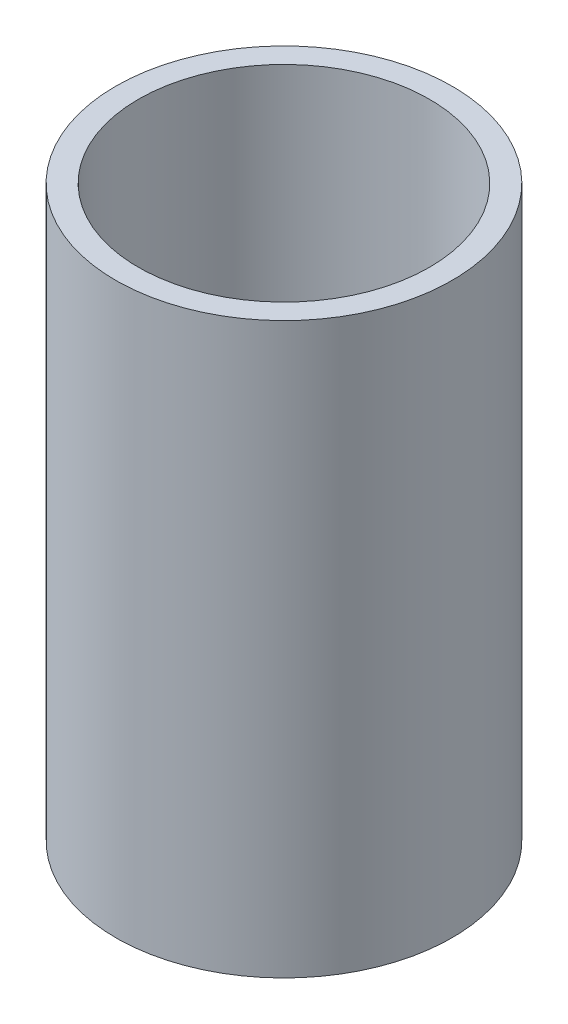
ISO-10303-21;
HEADER;
FILE_DESCRIPTION(('STEP AP214'),'2;1');
FILE_NAME('part.step','',(''),(''),'','','');
FILE_SCHEMA(('AUTOMOTIVE_DESIGN { 1 0 10303 214 1 1 1 1 }'));
ENDSEC;
DATA;
#1=APPLICATION_CONTEXT('core data for automotive mechanical design processes');
#2=APPLICATION_PROTOCOL_DEFINITION('international standard','automotive_design',2000,#1);
#3=PRODUCT_CONTEXT('',#1,'mechanical');
#4=PRODUCT('Part','Part','',(#3));
#5=PRODUCT_RELATED_PRODUCT_CATEGORY('part','',(#4));
#6=PRODUCT_DEFINITION_FORMATION('','',#4);
#7=PRODUCT_DEFINITION_CONTEXT('part definition',#1,'design');
#8=PRODUCT_DEFINITION('design','',#6,#7);
#9=PRODUCT_DEFINITION_SHAPE('','',#8);
#10=(LENGTH_UNIT() NAMED_UNIT(*) SI_UNIT(.MILLI.,.METRE.));
#11=(NAMED_UNIT(*) PLANE_ANGLE_UNIT() SI_UNIT($,.RADIAN.));
#12=(NAMED_UNIT(*) SI_UNIT($,.STERADIAN.) SOLID_ANGLE_UNIT());
#13=UNCERTAINTY_MEASURE_WITH_UNIT(LENGTH_MEASURE(1.E-05),#10,'distance_accuracy_value','');
#14=(GEOMETRIC_REPRESENTATION_CONTEXT(3) GLOBAL_UNCERTAINTY_ASSIGNED_CONTEXT((#13)) GLOBAL_UNIT_ASSIGNED_CONTEXT((#10,
#11,#12)) REPRESENTATION_CONTEXT('',''));
#15=CARTESIAN_POINT('',(0.,0.,0.));
#16=DIRECTION('',(0.,0.,1.));
#17=DIRECTION('',(1.,0.,0.));
#18=AXIS2_PLACEMENT_3D('',#15,#16,#17);
#19=CARTESIAN_POINT('',(-15.6,52.8,0.));
#20=DIRECTION('',(0.,1.,0.));
#21=DIRECTION('',(1.,0.,0.));
#22=AXIS2_PLACEMENT_3D('',#19,#20,#21);
#23=PLANE('',#22);
#24=CARTESIAN_POINT('',(-15.6,52.8,0.));
#25=DIRECTION('',(0.,1.,0.));
#26=DIRECTION('',(1.,0.,0.));
#27=AXIS2_PLACEMENT_3D('',#24,#25,#26);
#28=CIRCLE('',#27,9.);
#29=CARTESIAN_POINT('',(-24.6,52.8,0.));
#30=VERTEX_POINT('',#29);
#31=EDGE_CURVE('E62',#30,#30,#28,.T.);
#32=ORIENTED_EDGE('',*,*,#31,.T.);
#33=EDGE_LOOP('',(#32));
#34=FACE_BOUND('',#33,.T.);
#35=CARTESIAN_POINT('',(-15.6,52.8,0.));
#36=DIRECTION('',(0.,1.,0.));
#37=DIRECTION('',(1.,0.,0.));
#38=AXIS2_PLACEMENT_3D('',#35,#36,#37);
#39=CIRCLE('',#38,10.4);
#40=CARTESIAN_POINT('',(-26.,52.8,0.));
#41=VERTEX_POINT('',#40);
#42=EDGE_CURVE('E10',#41,#41,#39,.T.);
#43=ORIENTED_EDGE('',*,*,#42,.F.);
#44=EDGE_LOOP('',(#43));
#45=FACE_BOUND('',#44,.T.);
#46=ADVANCED_FACE('F15',(#34,#45),#23,.F.);
#47=CARTESIAN_POINT('',(-15.6,88.,0.));
#48=DIRECTION('',(0.,1.,0.));
#49=DIRECTION('',(1.,0.,0.));
#50=AXIS2_PLACEMENT_3D('',#47,#48,#49);
#51=PLANE('',#50);
#52=CARTESIAN_POINT('',(-15.6,88.,0.));
#53=DIRECTION('',(0.,-1.,0.));
#54=DIRECTION('',(1.,0.,0.));
#55=AXIS2_PLACEMENT_3D('',#52,#53,#54);
#56=CIRCLE('',#55,9.);
#57=CARTESIAN_POINT('',(-24.6,88.,0.));
#58=VERTEX_POINT('',#57);
#59=EDGE_CURVE('E46',#58,#58,#56,.T.);
#60=ORIENTED_EDGE('',*,*,#59,.T.);
#61=EDGE_LOOP('',(#60));
#62=FACE_BOUND('',#61,.T.);
#63=CARTESIAN_POINT('',(-15.6,88.,0.));
#64=DIRECTION('',(0.,1.,0.));
#65=DIRECTION('',(1.,0.,0.));
#66=AXIS2_PLACEMENT_3D('',#63,#64,#65);
#67=CIRCLE('',#66,10.4);
#68=CARTESIAN_POINT('',(-26.,88.,0.));
#69=VERTEX_POINT('',#68);
#70=EDGE_CURVE('E52',#69,#69,#67,.T.);
#71=ORIENTED_EDGE('',*,*,#70,.T.);
#72=EDGE_LOOP('',(#71));
#73=FACE_BOUND('',#72,.T.);
#74=ADVANCED_FACE('F47',(#62,#73),#51,.T.);
#75=CARTESIAN_POINT('',(-15.6,52.8,0.));
#76=DIRECTION('',(0.,1.,0.));
#77=DIRECTION('',(1.,0.,0.));
#78=AXIS2_PLACEMENT_3D('',#75,#76,#77);
#79=CYLINDRICAL_SURFACE('',#78,10.4);
#80=ORIENTED_EDGE('',*,*,#70,.F.);
#81=DIRECTION('',(0.,-1.,0.));
#82=VECTOR('',#81,1.);
#83=CARTESIAN_POINT('',(-26.,52.8,0.));
#84=LINE('',#83,#82);
#85=EDGE_CURVE('E25',#69,#41,#84,.T.);
#86=ORIENTED_EDGE('',*,*,#85,.T.);
#87=ORIENTED_EDGE('',*,*,#42,.T.);
#88=ORIENTED_EDGE('',*,*,#85,.F.);
#89=EDGE_LOOP('',(#80,#86,#87,#88));
#90=FACE_BOUND('',#89,.T.);
#91=ADVANCED_FACE('F69',(#90),#79,.T.);
#92=CARTESIAN_POINT('',(-15.6,52.8,0.));
#93=DIRECTION('',(0.,1.,0.));
#94=DIRECTION('',(1.,0.,0.));
#95=AXIS2_PLACEMENT_3D('',#92,#93,#94);
#96=CYLINDRICAL_SURFACE('',#95,9.);
#97=ORIENTED_EDGE('',*,*,#31,.F.);
#98=DIRECTION('',(0.,1.,0.));
#99=VECTOR('',#98,1.);
#100=CARTESIAN_POINT('',(-24.6,52.8,0.));
#101=LINE('',#100,#99);
#102=EDGE_CURVE('E53',#30,#58,#101,.T.);
#103=ORIENTED_EDGE('',*,*,#102,.T.);
#104=ORIENTED_EDGE('',*,*,#59,.F.);
#105=ORIENTED_EDGE('',*,*,#102,.F.);
#106=EDGE_LOOP('',(#97,#103,#104,#105));
#107=FACE_BOUND('',#106,.T.);
#108=ADVANCED_FACE('F17',(#107),#96,.F.);
#109=CLOSED_SHELL('',(#46,#74,#91,#108));
#110=MANIFOLD_SOLID_BREP('B1',#109);
#111=ADVANCED_BREP_SHAPE_REPRESENTATION('',(#18,#110),#14);
#112=SHAPE_DEFINITION_REPRESENTATION(#9,#111);
ENDSEC;
END-ISO-10303-21;
